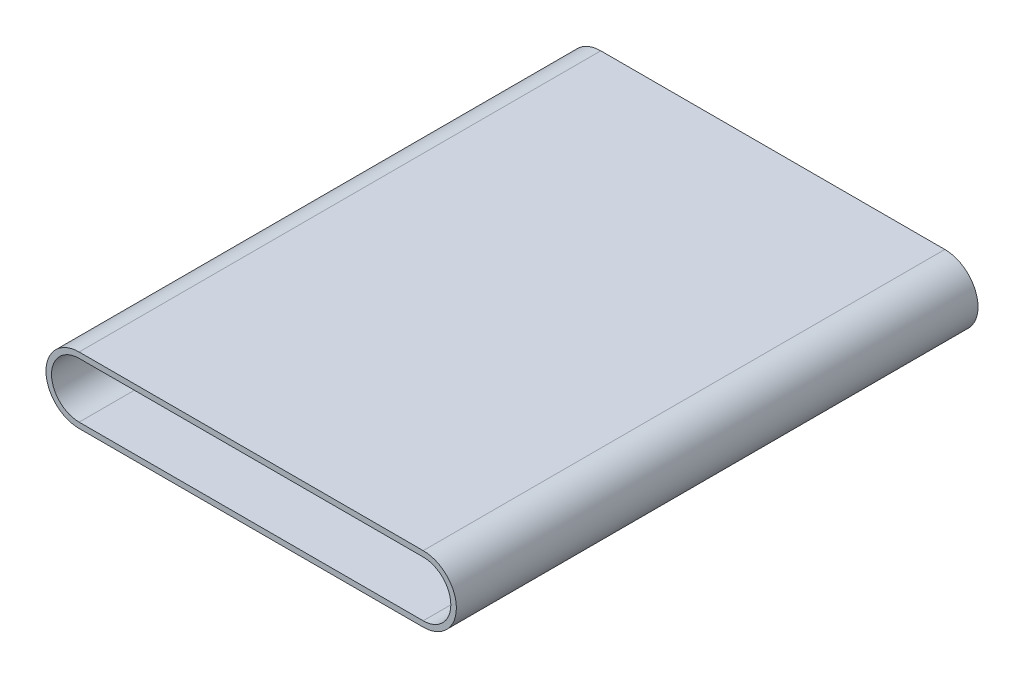
ISO-10303-21;
HEADER;
FILE_DESCRIPTION(('STEP AP214'),'2;1');
FILE_NAME('part.step','',(''),(''),'','','');
FILE_SCHEMA(('AUTOMOTIVE_DESIGN { 1 0 10303 214 1 1 1 1 }'));
ENDSEC;
DATA;
#1=APPLICATION_CONTEXT('core data for automotive mechanical design processes');
#2=APPLICATION_PROTOCOL_DEFINITION('international standard','automotive_design',2000,#1);
#3=PRODUCT_CONTEXT('',#1,'mechanical');
#4=PRODUCT('Part','Part','',(#3));
#5=PRODUCT_RELATED_PRODUCT_CATEGORY('part','',(#4));
#6=PRODUCT_DEFINITION_FORMATION('','',#4);
#7=PRODUCT_DEFINITION_CONTEXT('part definition',#1,'design');
#8=PRODUCT_DEFINITION('design','',#6,#7);
#9=PRODUCT_DEFINITION_SHAPE('','',#8);
#10=(LENGTH_UNIT() NAMED_UNIT(*) SI_UNIT(.MILLI.,.METRE.));
#11=(NAMED_UNIT(*) PLANE_ANGLE_UNIT() SI_UNIT($,.RADIAN.));
#12=(NAMED_UNIT(*) SI_UNIT($,.STERADIAN.) SOLID_ANGLE_UNIT());
#13=UNCERTAINTY_MEASURE_WITH_UNIT(LENGTH_MEASURE(1.E-05),#10,'distance_accuracy_value','');
#14=(GEOMETRIC_REPRESENTATION_CONTEXT(3) GLOBAL_UNCERTAINTY_ASSIGNED_CONTEXT((#13)) GLOBAL_UNIT_ASSIGNED_CONTEXT((#10,
#11,#12)) REPRESENTATION_CONTEXT('',''));
#15=CARTESIAN_POINT('',(0.,0.,0.));
#16=DIRECTION('',(0.,0.,1.));
#17=DIRECTION('',(1.,0.,0.));
#18=AXIS2_PLACEMENT_3D('',#15,#16,#17);
#19=CARTESIAN_POINT('',(-310.,24.8749999999997,235.));
#20=DIRECTION('',(0.,-1.,0.));
#21=DIRECTION('',(1.,0.,0.));
#22=AXIS2_PLACEMENT_3D('',#19,#20,#21);
#23=PLANE('',#22);
#24=DIRECTION('',(0.,0.,-1.));
#25=VECTOR('',#24,1.);
#26=CARTESIAN_POINT('',(-310.,24.8749999999997,235.));
#27=LINE('',#26,#25);
#28=CARTESIAN_POINT('',(-310.,24.8749999999997,235.));
#29=VERTEX_POINT('',#28);
#30=CARTESIAN_POINT('',(-310.,24.8749999999997,-235.));
#31=VERTEX_POINT('',#30);
#32=EDGE_CURVE('E124',#29,#31,#27,.T.);
#33=ORIENTED_EDGE('',*,*,#32,.T.);
#34=DIRECTION('',(1.,0.,0.));
#35=VECTOR('',#34,1.);
#36=CARTESIAN_POINT('',(-310.,24.8749999999997,-235.));
#37=LINE('',#36,#35);
#38=CARTESIAN_POINT('',(0.,24.8749999999999,-235.));
#39=VERTEX_POINT('',#38);
#40=EDGE_CURVE('E46',#31,#39,#37,.T.);
#41=ORIENTED_EDGE('',*,*,#40,.T.);
#42=CARTESIAN_POINT('',(0.,24.8749999999999,235.));
#43=DIRECTION('',(0.,0.,-1.));
#44=VECTOR('',#43,1.);
#45=LINE('',#42,#44);
#46=CARTESIAN_POINT('',(0.,24.8749999999999,235.));
#47=VERTEX_POINT('',#46);
#48=EDGE_CURVE('E115',#47,#39,#45,.T.);
#49=ORIENTED_EDGE('',*,*,#48,.F.);
#50=DIRECTION('',(1.,0.,0.));
#51=VECTOR('',#50,1.);
#52=CARTESIAN_POINT('',(-310.,24.8749999999997,235.));
#53=LINE('',#52,#51);
#54=EDGE_CURVE('E11',#29,#47,#53,.T.);
#55=ORIENTED_EDGE('',*,*,#54,.F.);
#56=EDGE_LOOP('',(#33,#41,#49,#55));
#57=FACE_BOUND('',#56,.T.);
#58=ADVANCED_FACE('F35',(#57),#23,.T.);
#59=CARTESIAN_POINT('',(-310.,29.8749999999997,235.));
#60=DIRECTION('',(0.,1.,0.));
#61=DIRECTION('',(-1.,0.,0.));
#62=AXIS2_PLACEMENT_3D('',#59,#60,#61);
#63=PLANE('',#62);
#64=DIRECTION('',(0.,0.,1.));
#65=VECTOR('',#64,1.);
#66=CARTESIAN_POINT('',(-310.,29.8749999999997,235.));
#67=LINE('',#66,#65);
#68=CARTESIAN_POINT('',(-310.,29.8749999999997,-235.));
#69=VERTEX_POINT('',#68);
#70=CARTESIAN_POINT('',(-310.,29.8749999999997,235.));
#71=VERTEX_POINT('',#70);
#72=EDGE_CURVE('E216',#69,#71,#67,.T.);
#73=ORIENTED_EDGE('',*,*,#72,.T.);
#74=DIRECTION('',(1.,0.,0.));
#75=VECTOR('',#74,1.);
#76=CARTESIAN_POINT('',(-310.,29.8749999999997,235.));
#77=LINE('',#76,#75);
#78=CARTESIAN_POINT('',(0.,29.8749999999999,235.));
#79=VERTEX_POINT('',#78);
#80=EDGE_CURVE('E62',#71,#79,#77,.T.);
#81=ORIENTED_EDGE('',*,*,#80,.T.);
#82=CARTESIAN_POINT('',(0.,29.8749999999999,-235.));
#83=DIRECTION('',(0.,0.,1.));
#84=VECTOR('',#83,1.);
#85=LINE('',#82,#84);
#86=CARTESIAN_POINT('',(0.,29.8749999999999,-235.));
#87=VERTEX_POINT('',#86);
#88=EDGE_CURVE('E120',#87,#79,#85,.T.);
#89=ORIENTED_EDGE('',*,*,#88,.F.);
#90=DIRECTION('',(1.,0.,0.));
#91=VECTOR('',#90,1.);
#92=CARTESIAN_POINT('',(-310.,29.8749999999997,-235.));
#93=LINE('',#92,#91);
#94=EDGE_CURVE('E126',#69,#87,#93,.T.);
#95=ORIENTED_EDGE('',*,*,#94,.F.);
#96=EDGE_LOOP('',(#73,#81,#89,#95));
#97=FACE_BOUND('',#96,.T.);
#98=ADVANCED_FACE('F144',(#97),#63,.T.);
#99=CARTESIAN_POINT('',(-310.,-1.11022302462516E-13,0.));
#100=DIRECTION('',(0.,0.,-1.));
#101=DIRECTION('',(-1.,0.,0.));
#102=AXIS2_PLACEMENT_3D('',#99,#100,#101);
#103=CYLINDRICAL_SURFACE('',#102,24.8749999999998);
#104=DIRECTION('',(0.,0.,-1.));
#105=VECTOR('',#104,1.);
#106=CARTESIAN_POINT('',(-310.,-24.8749999999999,235.));
#107=LINE('',#106,#105);
#108=CARTESIAN_POINT('',(-310.,-24.8749999999999,235.));
#109=VERTEX_POINT('',#108);
#110=CARTESIAN_POINT('',(-310.,-24.8749999999999,-235.));
#111=VERTEX_POINT('',#110);
#112=EDGE_CURVE('E227',#109,#111,#107,.T.);
#113=ORIENTED_EDGE('',*,*,#112,.T.);
#114=CARTESIAN_POINT('',(-310.,-1.11022302462516E-13,-235.));
#115=DIRECTION('',(0.,0.,-1.));
#116=DIRECTION('',(-1.,0.,0.));
#117=AXIS2_PLACEMENT_3D('',#114,#115,#116);
#118=CIRCLE('',#117,24.8749999999998);
#119=EDGE_CURVE('E198',#111,#31,#118,.T.);
#120=ORIENTED_EDGE('',*,*,#119,.T.);
#121=ORIENTED_EDGE('',*,*,#32,.F.);
#122=CARTESIAN_POINT('',(-310.,-1.11022302462516E-13,235.));
#123=DIRECTION('',(0.,0.,-1.));
#124=DIRECTION('',(-1.,0.,0.));
#125=AXIS2_PLACEMENT_3D('',#122,#123,#124);
#126=CIRCLE('',#125,24.8749999999998);
#127=EDGE_CURVE('E196',#109,#29,#126,.T.);
#128=ORIENTED_EDGE('',*,*,#127,.F.);
#129=EDGE_LOOP('',(#113,#120,#121,#128));
#130=FACE_BOUND('',#129,.T.);
#131=ADVANCED_FACE('F153',(#130),#103,.F.);
#132=CARTESIAN_POINT('',(-310.,-1.11022302462516E-13,0.));
#133=DIRECTION('',(0.,0.,-1.));
#134=DIRECTION('',(-1.,0.,0.));
#135=AXIS2_PLACEMENT_3D('',#132,#133,#134);
#136=CYLINDRICAL_SURFACE('',#135,29.8749999999998);
#137=DIRECTION('',(0.,0.,1.));
#138=VECTOR('',#137,1.);
#139=CARTESIAN_POINT('',(-310.,-29.8749999999999,235.));
#140=LINE('',#139,#138);
#141=CARTESIAN_POINT('',(-310.,-29.8749999999999,-235.));
#142=VERTEX_POINT('',#141);
#143=CARTESIAN_POINT('',(-310.,-29.8749999999999,235.));
#144=VERTEX_POINT('',#143);
#145=EDGE_CURVE('E230',#142,#144,#140,.T.);
#146=ORIENTED_EDGE('',*,*,#145,.T.);
#147=CARTESIAN_POINT('',(-310.,-1.11022302462516E-13,235.));
#148=DIRECTION('',(0.,0.,-1.));
#149=DIRECTION('',(-1.,0.,0.));
#150=AXIS2_PLACEMENT_3D('',#147,#148,#149);
#151=CIRCLE('',#150,29.8749999999998);
#152=EDGE_CURVE('E212',#144,#71,#151,.T.);
#153=ORIENTED_EDGE('',*,*,#152,.T.);
#154=ORIENTED_EDGE('',*,*,#72,.F.);
#155=CARTESIAN_POINT('',(-310.,-1.11022302462516E-13,-235.));
#156=DIRECTION('',(0.,0.,-1.));
#157=DIRECTION('',(-1.,0.,0.));
#158=AXIS2_PLACEMENT_3D('',#155,#156,#157);
#159=CIRCLE('',#158,29.8749999999998);
#160=EDGE_CURVE('E202',#142,#69,#159,.T.);
#161=ORIENTED_EDGE('',*,*,#160,.F.);
#162=EDGE_LOOP('',(#146,#153,#154,#161));
#163=FACE_BOUND('',#162,.T.);
#164=ADVANCED_FACE('F156',(#163),#136,.T.);
#165=CARTESIAN_POINT('',(0.,-24.8749999999998,235.));
#166=DIRECTION('',(0.,1.,0.));
#167=DIRECTION('',(-1.,0.,0.));
#168=AXIS2_PLACEMENT_3D('',#165,#166,#167);
#169=PLANE('',#168);
#170=DIRECTION('',(0.,0.,-1.));
#171=VECTOR('',#170,1.);
#172=CARTESIAN_POINT('',(0.,-24.8749999999998,235.));
#173=LINE('',#172,#171);
#174=CARTESIAN_POINT('',(0.,-24.8749999999998,235.));
#175=VERTEX_POINT('',#174);
#176=CARTESIAN_POINT('',(0.,-24.8749999999998,-235.));
#177=VERTEX_POINT('',#176);
#178=EDGE_CURVE('E236',#175,#177,#173,.T.);
#179=ORIENTED_EDGE('',*,*,#178,.T.);
#180=DIRECTION('',(-1.,0.,0.));
#181=VECTOR('',#180,1.);
#182=CARTESIAN_POINT('',(0.,-24.8749999999998,-235.));
#183=LINE('',#182,#181);
#184=EDGE_CURVE('E111',#177,#111,#183,.T.);
#185=ORIENTED_EDGE('',*,*,#184,.T.);
#186=ORIENTED_EDGE('',*,*,#112,.F.);
#187=DIRECTION('',(-1.,0.,0.));
#188=VECTOR('',#187,1.);
#189=CARTESIAN_POINT('',(0.,-24.8749999999998,235.));
#190=LINE('',#189,#188);
#191=EDGE_CURVE('E218',#175,#109,#190,.T.);
#192=ORIENTED_EDGE('',*,*,#191,.F.);
#193=EDGE_LOOP('',(#179,#185,#186,#192));
#194=FACE_BOUND('',#193,.T.);
#195=ADVANCED_FACE('F160',(#194),#169,.T.);
#196=CARTESIAN_POINT('',(0.,-29.8749999999998,235.));
#197=DIRECTION('',(0.,-1.,0.));
#198=DIRECTION('',(1.,0.,0.));
#199=AXIS2_PLACEMENT_3D('',#196,#197,#198);
#200=PLANE('',#199);
#201=DIRECTION('',(0.,0.,1.));
#202=VECTOR('',#201,1.);
#203=CARTESIAN_POINT('',(0.,-29.8749999999998,235.));
#204=LINE('',#203,#202);
#205=CARTESIAN_POINT('',(0.,-29.8749999999998,-235.));
#206=VERTEX_POINT('',#205);
#207=CARTESIAN_POINT('',(0.,-29.8749999999998,235.));
#208=VERTEX_POINT('',#207);
#209=EDGE_CURVE('E233',#206,#208,#204,.T.);
#210=ORIENTED_EDGE('',*,*,#209,.T.);
#211=DIRECTION('',(-1.,0.,0.));
#212=VECTOR('',#211,1.);
#213=CARTESIAN_POINT('',(0.,-29.8749999999998,235.));
#214=LINE('',#213,#212);
#215=EDGE_CURVE('E224',#208,#144,#214,.T.);
#216=ORIENTED_EDGE('',*,*,#215,.T.);
#217=ORIENTED_EDGE('',*,*,#145,.F.);
#218=DIRECTION('',(-1.,0.,0.));
#219=VECTOR('',#218,1.);
#220=CARTESIAN_POINT('',(0.,-29.8749999999998,-235.));
#221=LINE('',#220,#219);
#222=EDGE_CURVE('E221',#206,#142,#221,.T.);
#223=ORIENTED_EDGE('',*,*,#222,.F.);
#224=EDGE_LOOP('',(#210,#216,#217,#223));
#225=FACE_BOUND('',#224,.T.);
#226=ADVANCED_FACE('F164',(#225),#200,.T.);
#227=CARTESIAN_POINT('',(0.,-24.8749999999998,235.));
#228=DIRECTION('',(0.,0.,-1.));
#229=DIRECTION('',(-1.,0.,0.));
#230=AXIS2_PLACEMENT_3D('',#227,#228,#229);
#231=PLANE('',#230);
#232=CARTESIAN_POINT('',(0.,0.,235.));
#233=DIRECTION('',(0.,0.,1.));
#234=DIRECTION('',(1.,0.,0.));
#235=AXIS2_PLACEMENT_3D('',#232,#233,#234);
#236=CIRCLE('',#235,24.8749999999998);
#237=EDGE_CURVE('E54',#175,#47,#236,.T.);
#238=ORIENTED_EDGE('',*,*,#237,.F.);
#239=ORIENTED_EDGE('',*,*,#191,.T.);
#240=ORIENTED_EDGE('',*,*,#127,.T.);
#241=ORIENTED_EDGE('',*,*,#54,.T.);
#242=EDGE_LOOP('',(#238,#239,#240,#241));
#243=FACE_BOUND('',#242,.T.);
#244=CARTESIAN_POINT('',(0.,0.,235.));
#245=DIRECTION('',(0.,0.,1.));
#246=DIRECTION('',(1.,0.,0.));
#247=AXIS2_PLACEMENT_3D('',#244,#245,#246);
#248=CIRCLE('',#247,29.8749999999998);
#249=EDGE_CURVE('E191',#208,#79,#248,.T.);
#250=ORIENTED_EDGE('',*,*,#249,.T.);
#251=ORIENTED_EDGE('',*,*,#80,.F.);
#252=ORIENTED_EDGE('',*,*,#152,.F.);
#253=ORIENTED_EDGE('',*,*,#215,.F.);
#254=EDGE_LOOP('',(#250,#251,#252,#253));
#255=FACE_BOUND('',#254,.T.);
#256=ADVANCED_FACE('F167',(#243,#255),#231,.F.);
#257=CARTESIAN_POINT('',(0.,0.,0.));
#258=DIRECTION('',(0.,0.,1.));
#259=DIRECTION('',(1.,0.,0.));
#260=AXIS2_PLACEMENT_3D('',#257,#258,#259);
#261=CYLINDRICAL_SURFACE('',#260,29.8749999999998);
#262=CARTESIAN_POINT('',(0.,0.,-235.));
#263=DIRECTION('',(0.,0.,1.));
#264=DIRECTION('',(1.,0.,0.));
#265=AXIS2_PLACEMENT_3D('',#262,#263,#264);
#266=CIRCLE('',#265,29.8749999999998);
#267=EDGE_CURVE('E113',#206,#87,#266,.T.);
#268=ORIENTED_EDGE('',*,*,#267,.T.);
#269=ORIENTED_EDGE('',*,*,#88,.T.);
#270=ORIENTED_EDGE('',*,*,#249,.F.);
#271=ORIENTED_EDGE('',*,*,#209,.F.);
#272=EDGE_LOOP('',(#268,#269,#270,#271));
#273=FACE_BOUND('',#272,.T.);
#274=ADVANCED_FACE('F169',(#273),#261,.T.);
#275=CARTESIAN_POINT('',(0.,-24.8749999999998,-235.));
#276=DIRECTION('',(0.,0.,1.));
#277=DIRECTION('',(1.,0.,0.));
#278=AXIS2_PLACEMENT_3D('',#275,#276,#277);
#279=PLANE('',#278);
#280=ORIENTED_EDGE('',*,*,#267,.F.);
#281=ORIENTED_EDGE('',*,*,#222,.T.);
#282=ORIENTED_EDGE('',*,*,#160,.T.);
#283=ORIENTED_EDGE('',*,*,#94,.T.);
#284=EDGE_LOOP('',(#280,#281,#282,#283));
#285=FACE_BOUND('',#284,.T.);
#286=CARTESIAN_POINT('',(0.,0.,-235.));
#287=DIRECTION('',(0.,0.,1.));
#288=DIRECTION('',(1.,0.,0.));
#289=AXIS2_PLACEMENT_3D('',#286,#287,#288);
#290=CIRCLE('',#289,24.8749999999998);
#291=EDGE_CURVE('E106',#177,#39,#290,.T.);
#292=ORIENTED_EDGE('',*,*,#291,.T.);
#293=ORIENTED_EDGE('',*,*,#40,.F.);
#294=ORIENTED_EDGE('',*,*,#119,.F.);
#295=ORIENTED_EDGE('',*,*,#184,.F.);
#296=EDGE_LOOP('',(#292,#293,#294,#295));
#297=FACE_BOUND('',#296,.T.);
#298=ADVANCED_FACE('F107',(#285,#297),#279,.F.);
#299=CARTESIAN_POINT('',(0.,0.,0.));
#300=DIRECTION('',(0.,0.,1.));
#301=DIRECTION('',(1.,0.,0.));
#302=AXIS2_PLACEMENT_3D('',#299,#300,#301);
#303=CYLINDRICAL_SURFACE('',#302,24.8749999999998);
#304=ORIENTED_EDGE('',*,*,#178,.F.);
#305=ORIENTED_EDGE('',*,*,#237,.T.);
#306=ORIENTED_EDGE('',*,*,#48,.T.);
#307=ORIENTED_EDGE('',*,*,#291,.F.);
#308=EDGE_LOOP('',(#304,#305,#306,#307));
#309=FACE_BOUND('',#308,.T.);
#310=ADVANCED_FACE('F117',(#309),#303,.F.);
#311=CLOSED_SHELL('',(#58,#98,#131,#164,#195,#226,#256,#274,#298,#310));
#312=MANIFOLD_SOLID_BREP('B2',#311);
#313=ADVANCED_BREP_SHAPE_REPRESENTATION('',(#18,#312),#14);
#314=SHAPE_DEFINITION_REPRESENTATION(#9,#313);
ENDSEC;
END-ISO-10303-21;
